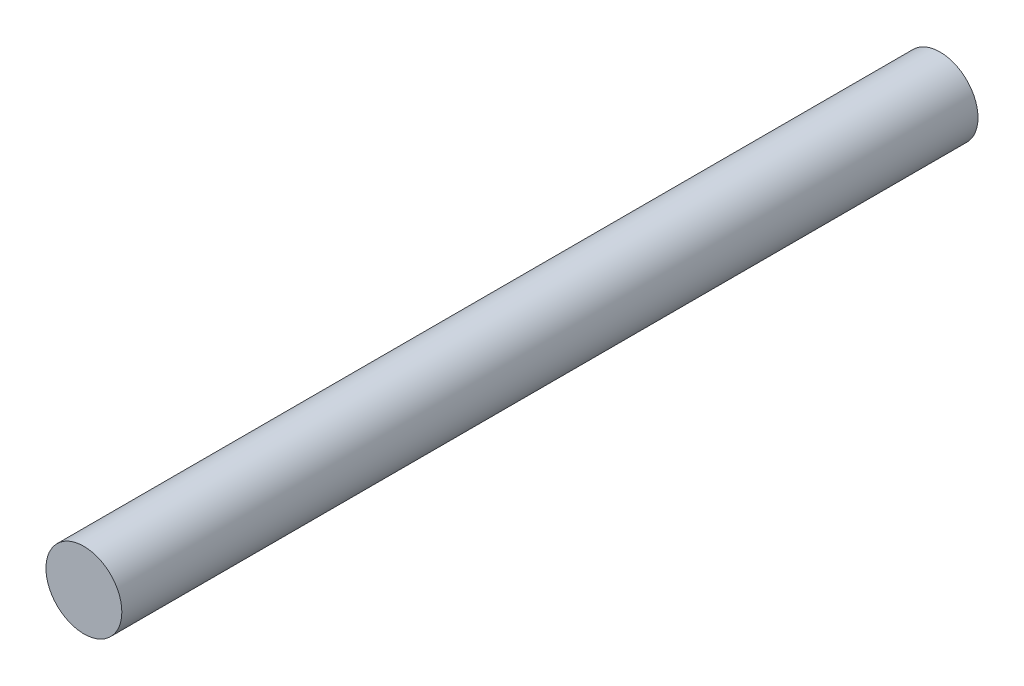
ISO-10303-21;
HEADER;
FILE_DESCRIPTION(('STEP AP214'),'2;1');
FILE_NAME('part.step','',(''),(''),'','','');
FILE_SCHEMA(('AUTOMOTIVE_DESIGN { 1 0 10303 214 1 1 1 1 }'));
ENDSEC;
DATA;
#1=APPLICATION_CONTEXT('core data for automotive mechanical design processes');
#2=APPLICATION_PROTOCOL_DEFINITION('international standard','automotive_design',2000,#1);
#3=PRODUCT_CONTEXT('',#1,'mechanical');
#4=PRODUCT('Part','Part','',(#3));
#5=PRODUCT_RELATED_PRODUCT_CATEGORY('part','',(#4));
#6=PRODUCT_DEFINITION_FORMATION('','',#4);
#7=PRODUCT_DEFINITION_CONTEXT('part definition',#1,'design');
#8=PRODUCT_DEFINITION('design','',#6,#7);
#9=PRODUCT_DEFINITION_SHAPE('','',#8);
#10=(LENGTH_UNIT() NAMED_UNIT(*) SI_UNIT(.MILLI.,.METRE.));
#11=(NAMED_UNIT(*) PLANE_ANGLE_UNIT() SI_UNIT($,.RADIAN.));
#12=(NAMED_UNIT(*) SI_UNIT($,.STERADIAN.) SOLID_ANGLE_UNIT());
#13=UNCERTAINTY_MEASURE_WITH_UNIT(LENGTH_MEASURE(1.E-05),#10,'distance_accuracy_value','');
#14=(GEOMETRIC_REPRESENTATION_CONTEXT(3) GLOBAL_UNCERTAINTY_ASSIGNED_CONTEXT((#13)) GLOBAL_UNIT_ASSIGNED_CONTEXT((#10,
#11,#12)) REPRESENTATION_CONTEXT('',''));
#15=CARTESIAN_POINT('',(0.,0.,0.));
#16=DIRECTION('',(0.,0.,1.));
#17=DIRECTION('',(1.,0.,0.));
#18=AXIS2_PLACEMENT_3D('',#15,#16,#17);
#19=CARTESIAN_POINT('',(0.,0.,38.1));
#20=DIRECTION('',(0.,0.,-1.));
#21=DIRECTION('',(-1.,0.,0.));
#22=AXIS2_PLACEMENT_3D('',#19,#20,#21);
#23=CYLINDRICAL_SURFACE('',#22,3.3782);
#24=CARTESIAN_POINT('',(0.,0.,38.1));
#25=DIRECTION('',(0.,0.,1.));
#26=DIRECTION('',(1.,0.,0.));
#27=AXIS2_PLACEMENT_3D('',#24,#25,#26);
#28=CIRCLE('',#27,3.3782);
#29=CARTESIAN_POINT('',(3.3782,0.,38.1));
#30=VERTEX_POINT('',#29);
#31=EDGE_CURVE('E10',#30,#30,#28,.T.);
#32=ORIENTED_EDGE('',*,*,#31,.F.);
#33=EDGE_LOOP('',(#32));
#34=FACE_BOUND('',#33,.T.);
#35=CARTESIAN_POINT('',(0.,0.,-38.1));
#36=DIRECTION('',(0.,0.,1.));
#37=DIRECTION('',(1.,0.,0.));
#38=AXIS2_PLACEMENT_3D('',#35,#36,#37);
#39=CIRCLE('',#38,3.3782);
#40=CARTESIAN_POINT('',(3.3782,0.,-38.1));
#41=VERTEX_POINT('',#40);
#42=EDGE_CURVE('E34',#41,#41,#39,.T.);
#43=ORIENTED_EDGE('',*,*,#42,.T.);
#44=EDGE_LOOP('',(#43));
#45=FACE_BOUND('',#44,.T.);
#46=ADVANCED_FACE('F31',(#34,#45),#23,.T.);
#47=CARTESIAN_POINT('',(0.,0.,38.1));
#48=DIRECTION('',(0.,0.,1.));
#49=DIRECTION('',(1.,0.,0.));
#50=AXIS2_PLACEMENT_3D('',#47,#48,#49);
#51=PLANE('',#50);
#52=ORIENTED_EDGE('',*,*,#31,.T.);
#53=EDGE_LOOP('',(#52));
#54=FACE_BOUND('',#53,.T.);
#55=ADVANCED_FACE('F46',(#54),#51,.T.);
#56=CARTESIAN_POINT('',(0.,0.,-38.1));
#57=DIRECTION('',(0.,0.,1.));
#58=DIRECTION('',(1.,0.,0.));
#59=AXIS2_PLACEMENT_3D('',#56,#57,#58);
#60=PLANE('',#59);
#61=ORIENTED_EDGE('',*,*,#42,.F.);
#62=EDGE_LOOP('',(#61));
#63=FACE_BOUND('',#62,.T.);
#64=ADVANCED_FACE('F44',(#63),#60,.F.);
#65=CLOSED_SHELL('',(#46,#55,#64));
#66=MANIFOLD_SOLID_BREP('B2',#65);
#67=ADVANCED_BREP_SHAPE_REPRESENTATION('',(#18,#66),#14);
#68=SHAPE_DEFINITION_REPRESENTATION(#9,#67);
ENDSEC;
END-ISO-10303-21;
